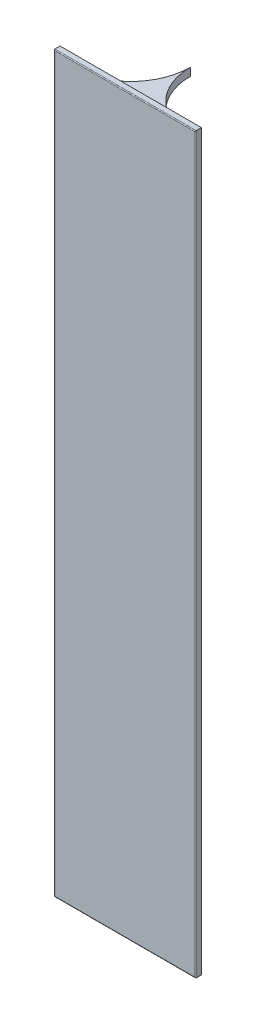
ISO-10303-21;
HEADER;
FILE_DESCRIPTION(('STEP AP214'),'2;1');
FILE_NAME('part.step','',(''),(''),'','','');
FILE_SCHEMA(('AUTOMOTIVE_DESIGN { 1 0 10303 214 1 1 1 1 }'));
ENDSEC;
DATA;
#1=APPLICATION_CONTEXT('core data for automotive mechanical design processes');
#2=APPLICATION_PROTOCOL_DEFINITION('international standard','automotive_design',2000,#1);
#3=PRODUCT_CONTEXT('',#1,'mechanical');
#4=PRODUCT('Part','Part','',(#3));
#5=PRODUCT_RELATED_PRODUCT_CATEGORY('part','',(#4));
#6=PRODUCT_DEFINITION_FORMATION('','',#4);
#7=PRODUCT_DEFINITION_CONTEXT('part definition',#1,'design');
#8=PRODUCT_DEFINITION('design','',#6,#7);
#9=PRODUCT_DEFINITION_SHAPE('','',#8);
#10=(LENGTH_UNIT() NAMED_UNIT(*) SI_UNIT(.MILLI.,.METRE.));
#11=(NAMED_UNIT(*) PLANE_ANGLE_UNIT() SI_UNIT($,.RADIAN.));
#12=(NAMED_UNIT(*) SI_UNIT($,.STERADIAN.) SOLID_ANGLE_UNIT());
#13=UNCERTAINTY_MEASURE_WITH_UNIT(LENGTH_MEASURE(1.E-05),#10,'distance_accuracy_value','');
#14=(GEOMETRIC_REPRESENTATION_CONTEXT(3) GLOBAL_UNCERTAINTY_ASSIGNED_CONTEXT((#13)) GLOBAL_UNIT_ASSIGNED_CONTEXT((#10,
#11,#12)) REPRESENTATION_CONTEXT('',''));
#15=CARTESIAN_POINT('',(0.,0.,0.));
#16=DIRECTION('',(0.,0.,1.));
#17=DIRECTION('',(1.,0.,0.));
#18=AXIS2_PLACEMENT_3D('',#15,#16,#17);
#19=CARTESIAN_POINT('',(-15.0000000000001,87.1670365016916,-14.9999999999999));
#20=DIRECTION('',(0.,1.,0.));
#21=DIRECTION('',(0.,0.,1.));
#22=AXIS2_PLACEMENT_3D('',#19,#20,#21);
#23=CYLINDRICAL_SURFACE('',#22,15.0000000000001);
#24=CARTESIAN_POINT('',(-15.0000000000001,89.1670365016916,-14.9999999999999));
#25=DIRECTION('',(0.,-1.,0.));
#26=DIRECTION('',(0.,0.,1.));
#27=AXIS2_PLACEMENT_3D('',#24,#25,#26);
#28=CIRCLE('',#27,15.0000000000001);
#29=CARTESIAN_POINT('',(2.18575157973078E-13,89.1670365016916,-14.9999999999998));
#30=VERTEX_POINT('',#29);
#31=CARTESIAN_POINT('',(-14.8136999104675,89.1670365016916,-0.00115696873117556));
#32=VERTEX_POINT('',#31);
#33=EDGE_CURVE('E94',#30,#32,#28,.T.);
#34=ORIENTED_EDGE('',*,*,#33,.F.);
#35=DIRECTION('',(0.,1.,0.));
#36=VECTOR('',#35,1.);
#37=CARTESIAN_POINT('',(2.18575157973078E-13,87.1670365016916,-14.9999999999998));
#38=LINE('',#37,#36);
#39=CARTESIAN_POINT('',(2.18575157973078E-13,87.1670365016916,-14.9999999999998));
#40=VERTEX_POINT('',#39);
#41=EDGE_CURVE('E12',#40,#30,#38,.T.);
#42=ORIENTED_EDGE('',*,*,#41,.F.);
#43=CARTESIAN_POINT('',(-15.0000000000001,87.1670365016916,-14.9999999999999));
#44=DIRECTION('',(0.,-1.,0.));
#45=DIRECTION('',(0.,0.,1.));
#46=AXIS2_PLACEMENT_3D('',#43,#44,#45);
#47=CIRCLE('',#46,15.0000000000001);
#48=CARTESIAN_POINT('',(-14.8136999104675,87.1670365016916,-0.00115696873117556));
#49=VERTEX_POINT('',#48);
#50=EDGE_CURVE('E86',#40,#49,#47,.T.);
#51=ORIENTED_EDGE('',*,*,#50,.T.);
#52=DIRECTION('',(0.,1.,0.));
#53=VECTOR('',#52,1.);
#54=CARTESIAN_POINT('',(-14.8136999104675,87.1670365016916,-0.00115696873117556));
#55=LINE('',#54,#53);
#56=EDGE_CURVE('E45',#49,#32,#55,.T.);
#57=ORIENTED_EDGE('',*,*,#56,.T.);
#58=EDGE_LOOP('',(#34,#42,#51,#57));
#59=FACE_BOUND('',#58,.T.);
#60=ADVANCED_FACE('F42',(#59),#23,.F.);
#61=CARTESIAN_POINT('',(15.0000000000003,87.1670365016916,-14.9999999999997));
#62=DIRECTION('',(0.,1.,0.));
#63=DIRECTION('',(0.,0.,1.));
#64=AXIS2_PLACEMENT_3D('',#61,#62,#63);
#65=CYLINDRICAL_SURFACE('',#64,15.0000000000001);
#66=CARTESIAN_POINT('',(15.0000000000003,89.1670365016916,-14.9999999999997));
#67=DIRECTION('',(0.,-1.,0.));
#68=DIRECTION('',(0.,0.,-1.));
#69=AXIS2_PLACEMENT_3D('',#66,#67,#68);
#70=CIRCLE('',#69,15.0000000000001);
#71=CARTESIAN_POINT('',(14.8136999104675,89.1670365016916,-0.00115696873085464));
#72=VERTEX_POINT('',#71);
#73=EDGE_CURVE('E88',#72,#30,#70,.T.);
#74=ORIENTED_EDGE('',*,*,#73,.F.);
#75=DIRECTION('',(0.,1.,0.));
#76=VECTOR('',#75,1.);
#77=CARTESIAN_POINT('',(14.8136999104675,87.1670365016916,-0.00115696873085464));
#78=LINE('',#77,#76);
#79=CARTESIAN_POINT('',(14.8136999104675,87.1670365016916,-0.00115696873085464));
#80=VERTEX_POINT('',#79);
#81=EDGE_CURVE('E51',#80,#72,#78,.T.);
#82=ORIENTED_EDGE('',*,*,#81,.F.);
#83=CARTESIAN_POINT('',(15.0000000000003,87.1670365016916,-14.9999999999997));
#84=DIRECTION('',(0.,-1.,0.));
#85=DIRECTION('',(0.,0.,-1.));
#86=AXIS2_PLACEMENT_3D('',#83,#84,#85);
#87=CIRCLE('',#86,15.0000000000001);
#88=EDGE_CURVE('E83',#80,#40,#87,.T.);
#89=ORIENTED_EDGE('',*,*,#88,.T.);
#90=ORIENTED_EDGE('',*,*,#41,.T.);
#91=EDGE_LOOP('',(#74,#82,#89,#90));
#92=FACE_BOUND('',#91,.T.);
#93=ADVANCED_FACE('F98',(#92),#65,.F.);
#94=CARTESIAN_POINT('',(14.8136999104675,87.1670365016916,-0.0011569687309713));
#95=DIRECTION('',(0.,0.,1.));
#96=DIRECTION('',(1.,0.,0.));
#97=AXIS2_PLACEMENT_3D('',#94,#95,#96);
#98=PLANE('',#97);
#99=DIRECTION('',(1.,0.,0.));
#100=VECTOR('',#99,1.);
#101=CARTESIAN_POINT('',(14.8136999104675,89.1670365016916,-0.0011569687309713));
#102=LINE('',#101,#100);
#103=EDGE_CURVE('E81',#32,#72,#102,.T.);
#104=ORIENTED_EDGE('',*,*,#103,.F.);
#105=ORIENTED_EDGE('',*,*,#56,.F.);
#106=DIRECTION('',(1.,0.,0.));
#107=VECTOR('',#106,1.);
#108=CARTESIAN_POINT('',(14.8136999104675,87.1670365016916,-0.0011569687309713));
#109=LINE('',#108,#107);
#110=EDGE_CURVE('E79',#49,#80,#109,.T.);
#111=ORIENTED_EDGE('',*,*,#110,.T.);
#112=ORIENTED_EDGE('',*,*,#81,.T.);
#113=EDGE_LOOP('',(#104,#105,#111,#112));
#114=FACE_BOUND('',#113,.T.);
#115=ADVANCED_FACE('F78',(#114),#98,.T.);
#116=CARTESIAN_POINT('',(-15.0000000000001,87.1670365016916,-14.9999999999999));
#117=DIRECTION('',(0.,1.,0.));
#118=DIRECTION('',(0.,0.,1.));
#119=AXIS2_PLACEMENT_3D('',#116,#117,#118);
#120=PLANE('',#119);
#121=ORIENTED_EDGE('',*,*,#50,.F.);
#122=ORIENTED_EDGE('',*,*,#88,.F.);
#123=ORIENTED_EDGE('',*,*,#110,.F.);
#124=EDGE_LOOP('',(#121,#122,#123));
#125=FACE_BOUND('',#124,.T.);
#126=ADVANCED_FACE('F85',(#125),#120,.F.);
#127=CARTESIAN_POINT('',(-15.0000000000001,89.1670365016916,-14.9999999999999));
#128=DIRECTION('',(0.,1.,0.));
#129=DIRECTION('',(0.,0.,1.));
#130=AXIS2_PLACEMENT_3D('',#127,#128,#129);
#131=PLANE('',#130);
#132=ORIENTED_EDGE('',*,*,#33,.T.);
#133=ORIENTED_EDGE('',*,*,#103,.T.);
#134=ORIENTED_EDGE('',*,*,#73,.T.);
#135=EDGE_LOOP('',(#132,#133,#134));
#136=FACE_BOUND('',#135,.T.);
#137=ADVANCED_FACE('F97',(#136),#131,.T.);
#138=CLOSED_SHELL('',(#60,#93,#115,#126,#137));
#139=MANIFOLD_SOLID_BREP('B2',#138);
#140=CARTESIAN_POINT('',(17.7999999999999,92.4,1.5));
#141=DIRECTION('',(-1.,0.,0.));
#142=DIRECTION('',(0.,0.,1.));
#143=AXIS2_PLACEMENT_3D('',#140,#141,#142);
#144=PLANE('',#143);
#145=DIRECTION('',(0.,0.,-1.));
#146=VECTOR('',#145,1.);
#147=CARTESIAN_POINT('',(17.7999999999999,92.4,1.5));
#148=LINE('',#147,#146);
#149=CARTESIAN_POINT('',(17.7999999999999,92.4,1.3));
#150=VERTEX_POINT('',#149);
#151=CARTESIAN_POINT('',(17.7999999999999,92.4,0.));
#152=VERTEX_POINT('',#151);
#153=EDGE_CURVE('E191',#150,#152,#148,.T.);
#154=ORIENTED_EDGE('',*,*,#153,.F.);
#155=DIRECTION('',(0.,1.,0.));
#156=VECTOR('',#155,1.);
#157=CARTESIAN_POINT('',(17.7999999999999,-92.4,1.3));
#158=LINE('',#157,#156);
#159=CARTESIAN_POINT('',(17.7999999999999,-92.4,1.3));
#160=VERTEX_POINT('',#159);
#161=EDGE_CURVE('E40',#150,#160,#158,.F.);
#162=ORIENTED_EDGE('',*,*,#161,.T.);
#163=DIRECTION('',(0.,0.,-1.));
#164=VECTOR('',#163,1.);
#165=CARTESIAN_POINT('',(17.7999999999999,-92.4,1.5));
#166=LINE('',#165,#164);
#167=CARTESIAN_POINT('',(17.7999999999999,-92.4,0.));
#168=VERTEX_POINT('',#167);
#169=EDGE_CURVE('E211',#160,#168,#166,.T.);
#170=ORIENTED_EDGE('',*,*,#169,.T.);
#171=DIRECTION('',(0.,1.,0.));
#172=VECTOR('',#171,1.);
#173=CARTESIAN_POINT('',(17.7999999999999,92.4,0.));
#174=LINE('',#173,#172);
#175=EDGE_CURVE('E206',#168,#152,#174,.T.);
#176=ORIENTED_EDGE('',*,*,#175,.T.);
#177=EDGE_LOOP('',(#154,#162,#170,#176));
#178=FACE_BOUND('',#177,.T.);
#179=ADVANCED_FACE('F139',(#178),#144,.F.);
#180=CARTESIAN_POINT('',(-17.7999999999999,92.4,1.5));
#181=DIRECTION('',(0.,-1.,0.));
#182=DIRECTION('',(0.,0.,-1.));
#183=AXIS2_PLACEMENT_3D('',#180,#181,#182);
#184=PLANE('',#183);
#185=DIRECTION('',(0.,0.,-1.));
#186=VECTOR('',#185,1.);
#187=CARTESIAN_POINT('',(-17.7999999999999,92.4,1.5));
#188=LINE('',#187,#186);
#189=CARTESIAN_POINT('',(-17.7999999999999,92.4,1.3));
#190=VERTEX_POINT('',#189);
#191=CARTESIAN_POINT('',(-17.7999999999999,92.4,0.));
#192=VERTEX_POINT('',#191);
#193=EDGE_CURVE('E200',#190,#192,#188,.T.);
#194=ORIENTED_EDGE('',*,*,#193,.F.);
#195=DIRECTION('',(-1.,0.,0.));
#196=VECTOR('',#195,1.);
#197=CARTESIAN_POINT('',(17.7999999999999,92.4,1.3));
#198=LINE('',#197,#196);
#199=EDGE_CURVE('E148',#190,#150,#198,.F.);
#200=ORIENTED_EDGE('',*,*,#199,.T.);
#201=ORIENTED_EDGE('',*,*,#153,.T.);
#202=DIRECTION('',(-1.,0.,0.));
#203=VECTOR('',#202,1.);
#204=CARTESIAN_POINT('',(-17.7999999999999,92.4,0.));
#205=LINE('',#204,#203);
#206=EDGE_CURVE('E194',#152,#192,#205,.T.);
#207=ORIENTED_EDGE('',*,*,#206,.T.);
#208=EDGE_LOOP('',(#194,#200,#201,#207));
#209=FACE_BOUND('',#208,.T.);
#210=ADVANCED_FACE('F193',(#209),#184,.F.);
#211=CARTESIAN_POINT('',(-17.7999999999999,92.4,1.5));
#212=DIRECTION('',(1.,0.,0.));
#213=DIRECTION('',(0.,0.,-1.));
#214=AXIS2_PLACEMENT_3D('',#211,#212,#213);
#215=PLANE('',#214);
#216=DIRECTION('',(0.,0.,-1.));
#217=VECTOR('',#216,1.);
#218=CARTESIAN_POINT('',(-17.7999999999999,-92.4,1.5));
#219=LINE('',#218,#217);
#220=CARTESIAN_POINT('',(-17.7999999999999,-92.4,1.3));
#221=VERTEX_POINT('',#220);
#222=CARTESIAN_POINT('',(-17.7999999999999,-92.4,0.));
#223=VERTEX_POINT('',#222);
#224=EDGE_CURVE('E221',#221,#223,#219,.T.);
#225=ORIENTED_EDGE('',*,*,#224,.F.);
#226=DIRECTION('',(0.,-1.,0.));
#227=VECTOR('',#226,1.);
#228=CARTESIAN_POINT('',(-17.7999999999999,92.4,1.3));
#229=LINE('',#228,#227);
#230=EDGE_CURVE('E163',#221,#190,#229,.F.);
#231=ORIENTED_EDGE('',*,*,#230,.T.);
#232=ORIENTED_EDGE('',*,*,#193,.T.);
#233=DIRECTION('',(0.,-1.,0.));
#234=VECTOR('',#233,1.);
#235=CARTESIAN_POINT('',(-17.7999999999999,92.4,0.));
#236=LINE('',#235,#234);
#237=EDGE_CURVE('E208',#192,#223,#236,.T.);
#238=ORIENTED_EDGE('',*,*,#237,.T.);
#239=EDGE_LOOP('',(#225,#231,#232,#238));
#240=FACE_BOUND('',#239,.T.);
#241=ADVANCED_FACE('F259',(#240),#215,.F.);
#242=CARTESIAN_POINT('',(-17.7999999999999,-92.4,1.5));
#243=DIRECTION('',(0.,1.,0.));
#244=DIRECTION('',(0.,0.,1.));
#245=AXIS2_PLACEMENT_3D('',#242,#243,#244);
#246=PLANE('',#245);
#247=ORIENTED_EDGE('',*,*,#169,.F.);
#248=DIRECTION('',(1.,0.,0.));
#249=VECTOR('',#248,1.);
#250=CARTESIAN_POINT('',(-17.7999999999999,-92.4,1.3));
#251=LINE('',#250,#249);
#252=EDGE_CURVE('E232',#160,#221,#251,.F.);
#253=ORIENTED_EDGE('',*,*,#252,.T.);
#254=ORIENTED_EDGE('',*,*,#224,.T.);
#255=DIRECTION('',(1.,0.,0.));
#256=VECTOR('',#255,1.);
#257=CARTESIAN_POINT('',(-17.7999999999999,-92.4,0.));
#258=LINE('',#257,#256);
#259=EDGE_CURVE('E218',#223,#168,#258,.T.);
#260=ORIENTED_EDGE('',*,*,#259,.T.);
#261=EDGE_LOOP('',(#247,#253,#254,#260));
#262=FACE_BOUND('',#261,.T.);
#263=ADVANCED_FACE('F258',(#262),#246,.F.);
#264=CARTESIAN_POINT('',(0.,0.,1.5));
#265=DIRECTION('',(0.,0.,1.));
#266=DIRECTION('',(1.,0.,0.));
#267=AXIS2_PLACEMENT_3D('',#264,#265,#266);
#268=PLANE('',#267);
#269=DIRECTION('',(0.,-1.,0.));
#270=VECTOR('',#269,1.);
#271=CARTESIAN_POINT('',(-17.5999999999999,-92.4,1.5));
#272=LINE('',#271,#270);
#273=CARTESIAN_POINT('',(-17.5999999999999,92.2,1.5));
#274=VERTEX_POINT('',#273);
#275=CARTESIAN_POINT('',(-17.5999999999999,-92.2,1.5));
#276=VERTEX_POINT('',#275);
#277=EDGE_CURVE('E227',#274,#276,#272,.T.);
#278=ORIENTED_EDGE('',*,*,#277,.T.);
#279=DIRECTION('',(1.,0.,0.));
#280=VECTOR('',#279,1.);
#281=CARTESIAN_POINT('',(17.7999999999999,-92.2,1.5));
#282=LINE('',#281,#280);
#283=CARTESIAN_POINT('',(17.5999999999999,-92.2,1.5));
#284=VERTEX_POINT('',#283);
#285=EDGE_CURVE('E229',#276,#284,#282,.T.);
#286=ORIENTED_EDGE('',*,*,#285,.T.);
#287=DIRECTION('',(0.,1.,0.));
#288=VECTOR('',#287,1.);
#289=CARTESIAN_POINT('',(17.5999999999999,92.4,1.5));
#290=LINE('',#289,#288);
#291=CARTESIAN_POINT('',(17.5999999999999,92.2,1.5));
#292=VERTEX_POINT('',#291);
#293=EDGE_CURVE('E199',#284,#292,#290,.T.);
#294=ORIENTED_EDGE('',*,*,#293,.T.);
#295=DIRECTION('',(-1.,0.,0.));
#296=VECTOR('',#295,1.);
#297=CARTESIAN_POINT('',(-17.7999999999999,92.2,1.5));
#298=LINE('',#297,#296);
#299=EDGE_CURVE('E225',#292,#274,#298,.T.);
#300=ORIENTED_EDGE('',*,*,#299,.T.);
#301=EDGE_LOOP('',(#278,#286,#294,#300));
#302=FACE_BOUND('',#301,.T.);
#303=ADVANCED_FACE('F251',(#302),#268,.T.);
#304=CARTESIAN_POINT('',(0.,0.,0.));
#305=DIRECTION('',(0.,0.,1.));
#306=DIRECTION('',(1.,0.,0.));
#307=AXIS2_PLACEMENT_3D('',#304,#305,#306);
#308=PLANE('',#307);
#309=ORIENTED_EDGE('',*,*,#175,.F.);
#310=ORIENTED_EDGE('',*,*,#259,.F.);
#311=ORIENTED_EDGE('',*,*,#237,.F.);
#312=ORIENTED_EDGE('',*,*,#206,.F.);
#313=EDGE_LOOP('',(#309,#310,#311,#312));
#314=FACE_BOUND('',#313,.T.);
#315=ADVANCED_FACE('F204',(#314),#308,.F.);
#316=CARTESIAN_POINT('',(0.,92.2,1.3));
#317=DIRECTION('',(1.,0.,0.));
#318=DIRECTION('',(0.,0.,-1.));
#319=AXIS2_PLACEMENT_3D('',#316,#317,#318);
#320=CYLINDRICAL_SURFACE('',#319,0.2);
#321=CARTESIAN_POINT('',(17.5999999999999,92.2,1.3));
#322=DIRECTION('',(0.707106781186547,-0.707106781186547,0.));
#323=DIRECTION('',(-0.707106781186547,-0.707106781186547,0.));
#324=AXIS2_PLACEMENT_3D('',#321,#322,#323);
#325=ELLIPSE('',#324,0.282842712474619,0.2);
#326=EDGE_CURVE('E215',#150,#292,#325,.T.);
#327=ORIENTED_EDGE('',*,*,#326,.F.);
#328=ORIENTED_EDGE('',*,*,#199,.F.);
#329=CARTESIAN_POINT('',(-17.5999999999999,92.2,1.3));
#330=DIRECTION('',(0.707106781186547,0.707106781186547,0.));
#331=DIRECTION('',(0.707106781186547,-0.707106781186547,0.));
#332=AXIS2_PLACEMENT_3D('',#329,#330,#331);
#333=ELLIPSE('',#332,0.282842712474619,0.2);
#334=EDGE_CURVE('E143',#274,#190,#333,.F.);
#335=ORIENTED_EDGE('',*,*,#334,.F.);
#336=ORIENTED_EDGE('',*,*,#299,.F.);
#337=EDGE_LOOP('',(#327,#328,#335,#336));
#338=FACE_BOUND('',#337,.T.);
#339=ADVANCED_FACE('F141',(#338),#320,.T.);
#340=CARTESIAN_POINT('',(-17.5999999999999,0.,1.3));
#341=DIRECTION('',(0.,1.,0.));
#342=DIRECTION('',(0.,0.,1.));
#343=AXIS2_PLACEMENT_3D('',#340,#341,#342);
#344=CYLINDRICAL_SURFACE('',#343,0.2);
#345=ORIENTED_EDGE('',*,*,#334,.T.);
#346=ORIENTED_EDGE('',*,*,#230,.F.);
#347=CARTESIAN_POINT('',(-17.5999999999999,-92.2,1.3));
#348=DIRECTION('',(-0.707106781186547,0.707106781186547,0.));
#349=DIRECTION('',(0.707106781186547,0.707106781186547,0.));
#350=AXIS2_PLACEMENT_3D('',#347,#348,#349);
#351=ELLIPSE('',#350,0.282842712474619,0.2);
#352=EDGE_CURVE('E239',#276,#221,#351,.F.);
#353=ORIENTED_EDGE('',*,*,#352,.F.);
#354=ORIENTED_EDGE('',*,*,#277,.F.);
#355=EDGE_LOOP('',(#345,#346,#353,#354));
#356=FACE_BOUND('',#355,.T.);
#357=ADVANCED_FACE('F276',(#356),#344,.T.);
#358=CARTESIAN_POINT('',(17.5999999999999,0.,1.3));
#359=DIRECTION('',(0.,-1.,0.));
#360=DIRECTION('',(0.,0.,-1.));
#361=AXIS2_PLACEMENT_3D('',#358,#359,#360);
#362=CYLINDRICAL_SURFACE('',#361,0.2);
#363=ORIENTED_EDGE('',*,*,#326,.T.);
#364=ORIENTED_EDGE('',*,*,#293,.F.);
#365=CARTESIAN_POINT('',(17.5999999999999,-92.2,1.3));
#366=DIRECTION('',(-0.707106781186547,-0.707106781186547,0.));
#367=DIRECTION('',(0.707106781186547,-0.707106781186547,0.));
#368=AXIS2_PLACEMENT_3D('',#365,#366,#367);
#369=ELLIPSE('',#368,0.282842712474619,0.2);
#370=EDGE_CURVE('E237',#160,#284,#369,.T.);
#371=ORIENTED_EDGE('',*,*,#370,.F.);
#372=ORIENTED_EDGE('',*,*,#161,.F.);
#373=EDGE_LOOP('',(#363,#364,#371,#372));
#374=FACE_BOUND('',#373,.T.);
#375=ADVANCED_FACE('F244',(#374),#362,.T.);
#376=CARTESIAN_POINT('',(0.,-92.2,1.3));
#377=DIRECTION('',(-1.,0.,0.));
#378=DIRECTION('',(0.,0.,1.));
#379=AXIS2_PLACEMENT_3D('',#376,#377,#378);
#380=CYLINDRICAL_SURFACE('',#379,0.2);
#381=ORIENTED_EDGE('',*,*,#352,.T.);
#382=ORIENTED_EDGE('',*,*,#252,.F.);
#383=ORIENTED_EDGE('',*,*,#370,.T.);
#384=ORIENTED_EDGE('',*,*,#285,.F.);
#385=EDGE_LOOP('',(#381,#382,#383,#384));
#386=FACE_BOUND('',#385,.T.);
#387=ADVANCED_FACE('F255',(#386),#380,.T.);
#388=CLOSED_SHELL('',(#179,#210,#241,#263,#303,#315,#339,#357,#375,#387));
#389=MANIFOLD_SOLID_BREP('B6',#388);
#390=ADVANCED_BREP_SHAPE_REPRESENTATION('',(#18,#139,#389),#14);
#391=SHAPE_DEFINITION_REPRESENTATION(#9,#390);
ENDSEC;
END-ISO-10303-21;
